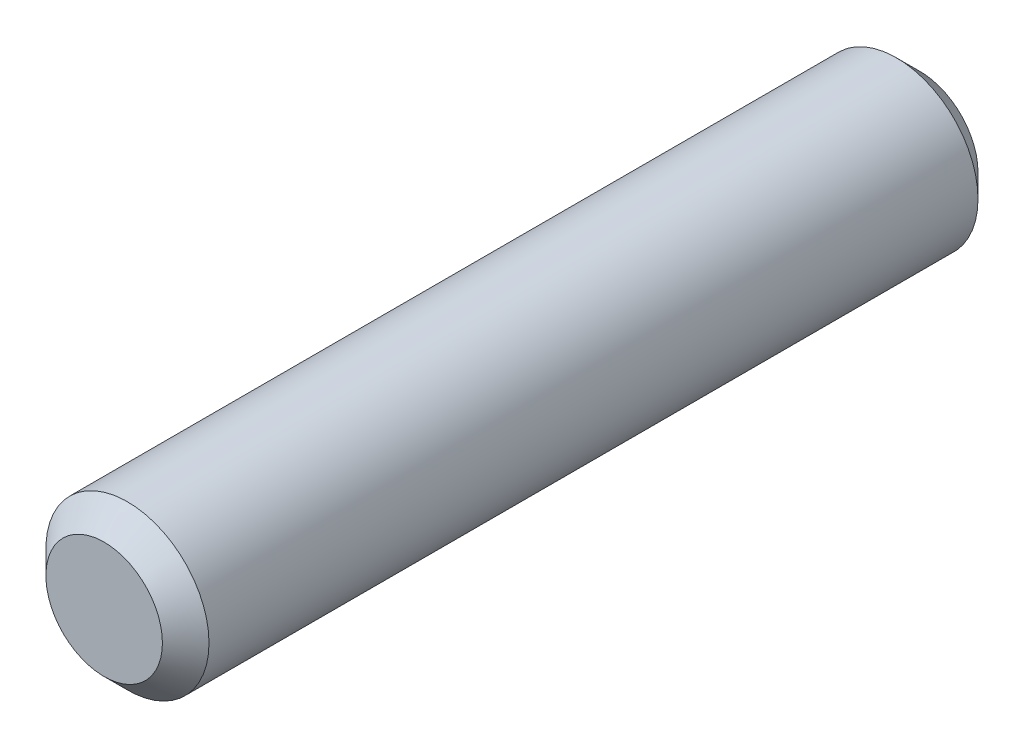
ISO-10303-21;
HEADER;
FILE_DESCRIPTION(('STEP AP214'),'2;1');
FILE_NAME('part.step','',(''),(''),'','','');
FILE_SCHEMA(('AUTOMOTIVE_DESIGN { 1 0 10303 214 1 1 1 1 }'));
ENDSEC;
DATA;
#1=APPLICATION_CONTEXT('core data for automotive mechanical design processes');
#2=APPLICATION_PROTOCOL_DEFINITION('international standard','automotive_design',2000,#1);
#3=PRODUCT_CONTEXT('',#1,'mechanical');
#4=PRODUCT('Part','Part','',(#3));
#5=PRODUCT_RELATED_PRODUCT_CATEGORY('part','',(#4));
#6=PRODUCT_DEFINITION_FORMATION('','',#4);
#7=PRODUCT_DEFINITION_CONTEXT('part definition',#1,'design');
#8=PRODUCT_DEFINITION('design','',#6,#7);
#9=PRODUCT_DEFINITION_SHAPE('','',#8);
#10=(LENGTH_UNIT() NAMED_UNIT(*) SI_UNIT(.MILLI.,.METRE.));
#11=(NAMED_UNIT(*) PLANE_ANGLE_UNIT() SI_UNIT($,.RADIAN.));
#12=(NAMED_UNIT(*) SI_UNIT($,.STERADIAN.) SOLID_ANGLE_UNIT());
#13=UNCERTAINTY_MEASURE_WITH_UNIT(LENGTH_MEASURE(1.E-05),#10,'distance_accuracy_value','');
#14=(GEOMETRIC_REPRESENTATION_CONTEXT(3) GLOBAL_UNCERTAINTY_ASSIGNED_CONTEXT((#13)) GLOBAL_UNIT_ASSIGNED_CONTEXT((#10,
#11,#12)) REPRESENTATION_CONTEXT('',''));
#15=CARTESIAN_POINT('',(0.,0.,0.));
#16=DIRECTION('',(0.,0.,1.));
#17=DIRECTION('',(1.,0.,0.));
#18=AXIS2_PLACEMENT_3D('',#15,#16,#17);
#19=CARTESIAN_POINT('',(0.,0.,35.));
#20=DIRECTION('',(0.,0.,-1.));
#21=DIRECTION('',(-1.,0.,0.));
#22=AXIS2_PLACEMENT_3D('',#19,#20,#21);
#23=CYLINDRICAL_SURFACE('',#22,7.);
#24=CARTESIAN_POINT('',(0.,0.,33.));
#25=DIRECTION('',(0.,0.,1.));
#26=DIRECTION('',(1.,0.,0.));
#27=AXIS2_PLACEMENT_3D('',#24,#25,#26);
#28=CIRCLE('',#27,7.);
#29=CARTESIAN_POINT('',(7.,0.,33.));
#30=VERTEX_POINT('',#29);
#31=EDGE_CURVE('E10',#30,#30,#28,.F.);
#32=ORIENTED_EDGE('',*,*,#31,.T.);
#33=EDGE_LOOP('',(#32));
#34=FACE_BOUND('',#33,.T.);
#35=CARTESIAN_POINT('',(0.,0.,-33.));
#36=DIRECTION('',(0.,0.,1.));
#37=DIRECTION('',(1.,0.,0.));
#38=AXIS2_PLACEMENT_3D('',#35,#36,#37);
#39=CIRCLE('',#38,7.);
#40=CARTESIAN_POINT('',(7.,0.,-33.));
#41=VERTEX_POINT('',#40);
#42=EDGE_CURVE('E62',#41,#41,#39,.T.);
#43=ORIENTED_EDGE('',*,*,#42,.T.);
#44=EDGE_LOOP('',(#43));
#45=FACE_BOUND('',#44,.T.);
#46=ADVANCED_FACE('F43',(#34,#45),#23,.T.);
#47=CARTESIAN_POINT('',(0.,0.,35.));
#48=DIRECTION('',(0.,0.,1.));
#49=DIRECTION('',(1.,0.,0.));
#50=AXIS2_PLACEMENT_3D('',#47,#48,#49);
#51=PLANE('',#50);
#52=CARTESIAN_POINT('',(0.,0.,35.));
#53=DIRECTION('',(0.,0.,1.));
#54=DIRECTION('',(1.,0.,0.));
#55=AXIS2_PLACEMENT_3D('',#52,#53,#54);
#56=CIRCLE('',#55,4.99999999999998);
#57=CARTESIAN_POINT('',(4.99999999999998,0.,35.));
#58=VERTEX_POINT('',#57);
#59=EDGE_CURVE('E52',#58,#58,#56,.T.);
#60=ORIENTED_EDGE('',*,*,#59,.T.);
#61=EDGE_LOOP('',(#60));
#62=FACE_BOUND('',#61,.T.);
#63=ADVANCED_FACE('F79',(#62),#51,.T.);
#64=CARTESIAN_POINT('',(0.,0.,-35.));
#65=DIRECTION('',(0.,0.,1.));
#66=DIRECTION('',(1.,0.,0.));
#67=AXIS2_PLACEMENT_3D('',#64,#65,#66);
#68=PLANE('',#67);
#69=CARTESIAN_POINT('',(0.,0.,-35.));
#70=DIRECTION('',(0.,0.,1.));
#71=DIRECTION('',(1.,0.,0.));
#72=AXIS2_PLACEMENT_3D('',#69,#70,#71);
#73=CIRCLE('',#72,4.99999999999999);
#74=CARTESIAN_POINT('',(4.99999999999999,0.,-35.));
#75=VERTEX_POINT('',#74);
#76=EDGE_CURVE('E57',#75,#75,#73,.F.);
#77=ORIENTED_EDGE('',*,*,#76,.T.);
#78=EDGE_LOOP('',(#77));
#79=FACE_BOUND('',#78,.T.);
#80=ADVANCED_FACE('F72',(#79),#68,.F.);
#81=CARTESIAN_POINT('',(0.,0.,-33.));
#82=DIRECTION('',(0.,0.,1.));
#83=DIRECTION('',(1.,0.,0.));
#84=AXIS2_PLACEMENT_3D('',#81,#82,#83);
#85=CONICAL_SURFACE('',#84,7.,0.78539816339745);
#86=ORIENTED_EDGE('',*,*,#76,.F.);
#87=EDGE_LOOP('',(#86));
#88=FACE_BOUND('',#87,.T.);
#89=ORIENTED_EDGE('',*,*,#42,.F.);
#90=EDGE_LOOP('',(#89));
#91=FACE_BOUND('',#90,.T.);
#92=ADVANCED_FACE('F70',(#88,#91),#85,.T.);
#93=CARTESIAN_POINT('',(0.,0.,35.));
#94=DIRECTION('',(0.,0.,-1.));
#95=DIRECTION('',(-1.,0.,0.));
#96=AXIS2_PLACEMENT_3D('',#93,#94,#95);
#97=CONICAL_SURFACE('',#96,4.99999999999998,0.785398163397445);
#98=ORIENTED_EDGE('',*,*,#31,.F.);
#99=EDGE_LOOP('',(#98));
#100=FACE_BOUND('',#99,.T.);
#101=ORIENTED_EDGE('',*,*,#59,.F.);
#102=EDGE_LOOP('',(#101));
#103=FACE_BOUND('',#102,.T.);
#104=ADVANCED_FACE('F46',(#100,#103),#97,.T.);
#105=CLOSED_SHELL('',(#46,#63,#80,#92,#104));
#106=MANIFOLD_SOLID_BREP('B2',#105);
#107=ADVANCED_BREP_SHAPE_REPRESENTATION('',(#18,#106),#14);
#108=SHAPE_DEFINITION_REPRESENTATION(#9,#107);
ENDSEC;
END-ISO-10303-21;
